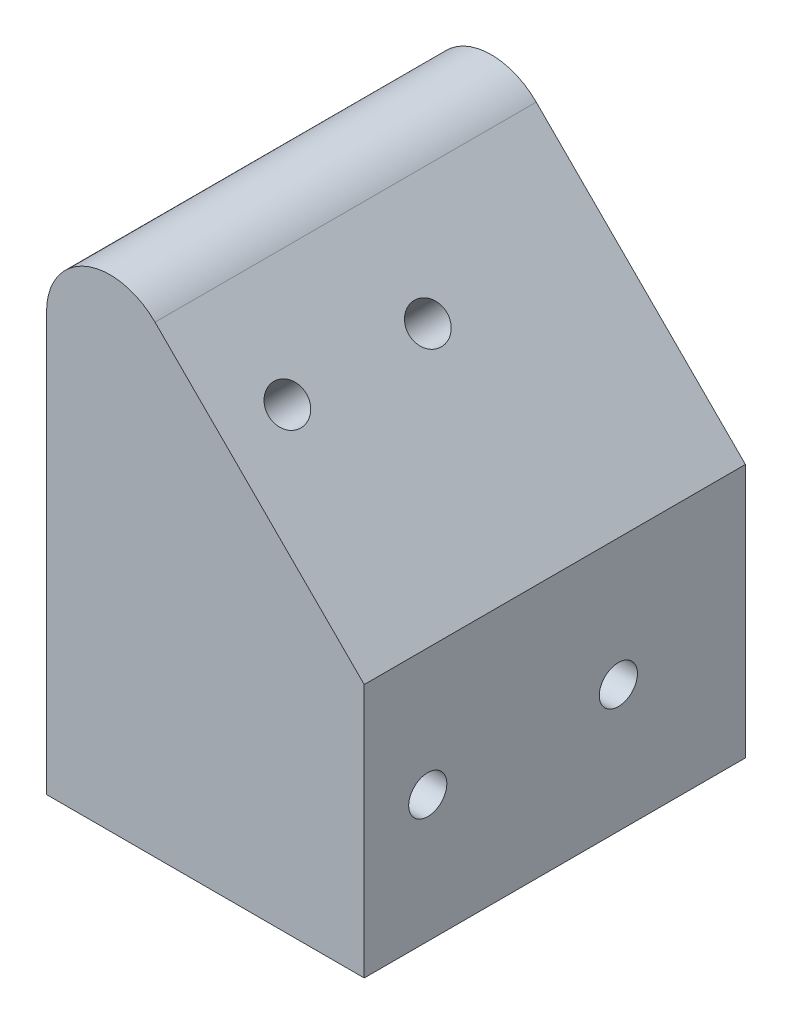
ISO-10303-21;
HEADER;
FILE_DESCRIPTION(('STEP AP214'),'2;1');
FILE_NAME('part.step','',(''),(''),'','','');
FILE_SCHEMA(('AUTOMOTIVE_DESIGN { 1 0 10303 214 1 1 1 1 }'));
ENDSEC;
DATA;
#1=APPLICATION_CONTEXT('core data for automotive mechanical design processes');
#2=APPLICATION_PROTOCOL_DEFINITION('international standard','automotive_design',2000,#1);
#3=PRODUCT_CONTEXT('',#1,'mechanical');
#4=PRODUCT('Part','Part','',(#3));
#5=PRODUCT_RELATED_PRODUCT_CATEGORY('part','',(#4));
#6=PRODUCT_DEFINITION_FORMATION('','',#4);
#7=PRODUCT_DEFINITION_CONTEXT('part definition',#1,'design');
#8=PRODUCT_DEFINITION('design','',#6,#7);
#9=PRODUCT_DEFINITION_SHAPE('','',#8);
#10=(LENGTH_UNIT() NAMED_UNIT(*) SI_UNIT(.MILLI.,.METRE.));
#11=(NAMED_UNIT(*) PLANE_ANGLE_UNIT() SI_UNIT($,.RADIAN.));
#12=(NAMED_UNIT(*) SI_UNIT($,.STERADIAN.) SOLID_ANGLE_UNIT());
#13=UNCERTAINTY_MEASURE_WITH_UNIT(LENGTH_MEASURE(1.E-05),#10,'distance_accuracy_value','');
#14=(GEOMETRIC_REPRESENTATION_CONTEXT(3) GLOBAL_UNCERTAINTY_ASSIGNED_CONTEXT((#13)) GLOBAL_UNIT_ASSIGNED_CONTEXT((#10,
#11,#12)) REPRESENTATION_CONTEXT('',''));
#15=CARTESIAN_POINT('',(0.,0.,0.));
#16=DIRECTION('',(0.,0.,1.));
#17=DIRECTION('',(1.,0.,0.));
#18=AXIS2_PLACEMENT_3D('',#15,#16,#17);
#19=CARTESIAN_POINT('',(25.,-20.,0.));
#20=DIRECTION('',(0.,0.,-1.));
#21=DIRECTION('',(1.,0.,0.));
#22=AXIS2_PLACEMENT_3D('',#19,#20,#21);
#23=PLANE('',#22);
#24=DIRECTION('',(0.,1.,0.));
#25=VECTOR('',#24,1.);
#26=CARTESIAN_POINT('',(0.,-20.,0.));
#27=LINE('',#26,#25);
#28=CARTESIAN_POINT('',(0.,-20.,0.));
#29=VERTEX_POINT('',#28);
#30=CARTESIAN_POINT('',(0.,12.9289321881344,0.));
#31=VERTEX_POINT('',#30);
#32=EDGE_CURVE('E107',#29,#31,#27,.T.);
#33=ORIENTED_EDGE('',*,*,#32,.F.);
#34=DIRECTION('',(-1.,0.,0.));
#35=VECTOR('',#34,1.);
#36=CARTESIAN_POINT('',(25.,-20.,0.));
#37=LINE('',#36,#35);
#38=CARTESIAN_POINT('',(25.,-20.,0.));
#39=VERTEX_POINT('',#38);
#40=EDGE_CURVE('E97',#39,#29,#37,.T.);
#41=ORIENTED_EDGE('',*,*,#40,.F.);
#42=DIRECTION('',(0.,1.,0.));
#43=VECTOR('',#42,1.);
#44=CARTESIAN_POINT('',(25.,-20.,0.));
#45=LINE('',#44,#43);
#46=CARTESIAN_POINT('',(25.,0.,0.));
#47=VERTEX_POINT('',#46);
#48=EDGE_CURVE('E81',#39,#47,#45,.T.);
#49=ORIENTED_EDGE('',*,*,#48,.T.);
#50=DIRECTION('',(0.707106781186551,-0.707106781186544,0.));
#51=VECTOR('',#50,1.);
#52=CARTESIAN_POINT('',(0.,24.9999999999997,0.));
#53=LINE('',#52,#51);
#54=CARTESIAN_POINT('',(8.53553390593272,16.4644660940671,0.));
#55=VERTEX_POINT('',#54);
#56=EDGE_CURVE('E88',#55,#47,#53,.T.);
#57=ORIENTED_EDGE('',*,*,#56,.F.);
#58=CARTESIAN_POINT('',(5.,12.9289321881344,0.));
#59=DIRECTION('',(0.,0.,1.));
#60=DIRECTION('',(1.,0.,0.));
#61=AXIS2_PLACEMENT_3D('',#58,#59,#60);
#62=CIRCLE('',#61,5.);
#63=EDGE_CURVE('E118',#31,#55,#62,.F.);
#64=ORIENTED_EDGE('',*,*,#63,.F.);
#65=EDGE_LOOP('',(#33,#41,#49,#57,#64));
#66=FACE_BOUND('',#65,.T.);
#67=ADVANCED_FACE('F33',(#66),#23,.F.);
#68=CARTESIAN_POINT('',(25.,-20.,-30.));
#69=DIRECTION('',(0.,0.,1.));
#70=DIRECTION('',(-1.,0.,0.));
#71=AXIS2_PLACEMENT_3D('',#68,#69,#70);
#72=PLANE('',#71);
#73=DIRECTION('',(0.707106781186551,-0.707106781186544,0.));
#74=VECTOR('',#73,1.);
#75=CARTESIAN_POINT('',(0.,24.9999999999997,-30.));
#76=LINE('',#75,#74);
#77=CARTESIAN_POINT('',(8.53553390593272,16.4644660940671,-30.));
#78=VERTEX_POINT('',#77);
#79=CARTESIAN_POINT('',(25.,0.,-30.));
#80=VERTEX_POINT('',#79);
#81=EDGE_CURVE('E92',#78,#80,#76,.T.);
#82=ORIENTED_EDGE('',*,*,#81,.T.);
#83=DIRECTION('',(0.,-1.,0.));
#84=VECTOR('',#83,1.);
#85=CARTESIAN_POINT('',(25.,-20.,-30.));
#86=LINE('',#85,#84);
#87=CARTESIAN_POINT('',(25.,-20.,-30.));
#88=VERTEX_POINT('',#87);
#89=EDGE_CURVE('E84',#80,#88,#86,.T.);
#90=ORIENTED_EDGE('',*,*,#89,.T.);
#91=DIRECTION('',(-1.,0.,0.));
#92=VECTOR('',#91,1.);
#93=CARTESIAN_POINT('',(25.,-20.,-30.));
#94=LINE('',#93,#92);
#95=CARTESIAN_POINT('',(0.,-20.,-30.));
#96=VERTEX_POINT('',#95);
#97=EDGE_CURVE('E113',#88,#96,#94,.T.);
#98=ORIENTED_EDGE('',*,*,#97,.T.);
#99=DIRECTION('',(0.,-1.,0.));
#100=VECTOR('',#99,1.);
#101=CARTESIAN_POINT('',(0.,-20.,-30.));
#102=LINE('',#101,#100);
#103=CARTESIAN_POINT('',(0.,12.9289321881344,-30.));
#104=VERTEX_POINT('',#103);
#105=EDGE_CURVE('E100',#104,#96,#102,.T.);
#106=ORIENTED_EDGE('',*,*,#105,.F.);
#107=CARTESIAN_POINT('',(5.,12.9289321881344,-30.));
#108=DIRECTION('',(0.,0.,-1.));
#109=DIRECTION('',(-1.,0.,0.));
#110=AXIS2_PLACEMENT_3D('',#107,#108,#109);
#111=CIRCLE('',#110,5.);
#112=EDGE_CURVE('E11',#78,#104,#111,.F.);
#113=ORIENTED_EDGE('',*,*,#112,.F.);
#114=EDGE_LOOP('',(#82,#90,#98,#106,#113));
#115=FACE_BOUND('',#114,.T.);
#116=ADVANCED_FACE('F126',(#115),#72,.F.);
#117=CARTESIAN_POINT('',(25.,-20.,0.));
#118=DIRECTION('',(0.,1.,0.));
#119=DIRECTION('',(0.,0.,-1.));
#120=AXIS2_PLACEMENT_3D('',#117,#118,#119);
#121=PLANE('',#120);
#122=DIRECTION('',(0.,0.,1.));
#123=VECTOR('',#122,1.);
#124=CARTESIAN_POINT('',(0.,-20.,0.));
#125=LINE('',#124,#123);
#126=EDGE_CURVE('E98',#96,#29,#125,.T.);
#127=ORIENTED_EDGE('',*,*,#126,.F.);
#128=ORIENTED_EDGE('',*,*,#97,.F.);
#129=DIRECTION('',(0.,0.,1.));
#130=VECTOR('',#129,1.);
#131=CARTESIAN_POINT('',(25.,-20.,0.));
#132=LINE('',#131,#130);
#133=EDGE_CURVE('E105',#88,#39,#132,.T.);
#134=ORIENTED_EDGE('',*,*,#133,.T.);
#135=ORIENTED_EDGE('',*,*,#40,.T.);
#136=EDGE_LOOP('',(#127,#128,#134,#135));
#137=FACE_BOUND('',#136,.T.);
#138=ADVANCED_FACE('F124',(#137),#121,.F.);
#139=CARTESIAN_POINT('',(25.,0.,0.));
#140=DIRECTION('',(1.,0.,0.));
#141=DIRECTION('',(0.,0.,1.));
#142=AXIS2_PLACEMENT_3D('',#139,#140,#141);
#143=PLANE('',#142);
#144=CARTESIAN_POINT('',(25.,-9.99999999999998,-4.99999999999714));
#145=DIRECTION('',(1.,0.,0.));
#146=DIRECTION('',(0.,0.,-1.));
#147=AXIS2_PLACEMENT_3D('',#144,#145,#146);
#148=CIRCLE('',#147,1.5);
#149=CARTESIAN_POINT('',(25.,-9.99999999999998,-6.49999999999714));
#150=VERTEX_POINT('',#149);
#151=EDGE_CURVE('E131',#150,#150,#148,.T.);
#152=ORIENTED_EDGE('',*,*,#151,.F.);
#153=EDGE_LOOP('',(#152));
#154=FACE_BOUND('',#153,.T.);
#155=CARTESIAN_POINT('',(25.,-9.99999999999998,-19.9999999999971));
#156=DIRECTION('',(1.,0.,0.));
#157=DIRECTION('',(0.,0.,-1.));
#158=AXIS2_PLACEMENT_3D('',#155,#156,#157);
#159=CIRCLE('',#158,1.5);
#160=CARTESIAN_POINT('',(25.,-9.99999999999998,-21.4999999999971));
#161=VERTEX_POINT('',#160);
#162=EDGE_CURVE('E93',#161,#161,#159,.T.);
#163=ORIENTED_EDGE('',*,*,#162,.F.);
#164=EDGE_LOOP('',(#163));
#165=FACE_BOUND('',#164,.T.);
#166=ORIENTED_EDGE('',*,*,#48,.F.);
#167=ORIENTED_EDGE('',*,*,#133,.F.);
#168=ORIENTED_EDGE('',*,*,#89,.F.);
#169=DIRECTION('',(0.,0.,-1.));
#170=VECTOR('',#169,1.);
#171=CARTESIAN_POINT('',(25.,0.,0.));
#172=LINE('',#171,#170);
#173=EDGE_CURVE('E78',#47,#80,#172,.T.);
#174=ORIENTED_EDGE('',*,*,#173,.F.);
#175=EDGE_LOOP('',(#166,#167,#168,#174));
#176=FACE_BOUND('',#175,.T.);
#177=ADVANCED_FACE('F79',(#154,#165,#176),#143,.T.);
#178=CARTESIAN_POINT('',(0.,0.,0.));
#179=DIRECTION('',(1.,0.,0.));
#180=DIRECTION('',(0.,0.,1.));
#181=AXIS2_PLACEMENT_3D('',#178,#179,#180);
#182=PLANE('',#181);
#183=CARTESIAN_POINT('',(0.,-2.89921398068884,-5.00066480476496));
#184=DIRECTION('',(-1.,0.,0.));
#185=DIRECTION('',(0.,1.,0.));
#186=AXIS2_PLACEMENT_3D('',#183,#184,#185);
#187=ELLIPSE('',#186,2.12132034360238,1.50000000003022);
#188=CARTESIAN_POINT('',(0.,-0.777893637086456,-5.00066480476496));
#189=VERTEX_POINT('',#188);
#190=EDGE_CURVE('E145',#189,#189,#187,.T.);
#191=ORIENTED_EDGE('',*,*,#190,.F.);
#192=EDGE_LOOP('',(#191));
#193=FACE_BOUND('',#192,.T.);
#194=CARTESIAN_POINT('',(0.,-2.89921398068883,-16.0566278642933));
#195=DIRECTION('',(-1.,0.,0.));
#196=DIRECTION('',(0.,1.,0.));
#197=AXIS2_PLACEMENT_3D('',#194,#195,#196);
#198=ELLIPSE('',#197,2.12132034360238,1.50000000003022);
#199=CARTESIAN_POINT('',(0.,-0.777893637086444,-16.0566278642933));
#200=VERTEX_POINT('',#199);
#201=EDGE_CURVE('E137',#200,#200,#198,.T.);
#202=ORIENTED_EDGE('',*,*,#201,.F.);
#203=EDGE_LOOP('',(#202));
#204=FACE_BOUND('',#203,.T.);
#205=CARTESIAN_POINT('',(0.,-9.99999999999998,-4.99999999999714));
#206=DIRECTION('',(1.,0.,0.));
#207=DIRECTION('',(0.,0.,-1.));
#208=AXIS2_PLACEMENT_3D('',#205,#206,#207);
#209=CIRCLE('',#208,1.5);
#210=CARTESIAN_POINT('',(0.,-9.99999999999998,-6.49999999999714));
#211=VERTEX_POINT('',#210);
#212=EDGE_CURVE('E134',#211,#211,#209,.T.);
#213=ORIENTED_EDGE('',*,*,#212,.T.);
#214=EDGE_LOOP('',(#213));
#215=FACE_BOUND('',#214,.T.);
#216=CARTESIAN_POINT('',(0.,-9.99999999999998,-19.9999999999971));
#217=DIRECTION('',(1.,0.,0.));
#218=DIRECTION('',(0.,0.,-1.));
#219=AXIS2_PLACEMENT_3D('',#216,#217,#218);
#220=CIRCLE('',#219,1.5);
#221=CARTESIAN_POINT('',(0.,-9.99999999999998,-21.4999999999971));
#222=VERTEX_POINT('',#221);
#223=EDGE_CURVE('E128',#222,#222,#220,.T.);
#224=ORIENTED_EDGE('',*,*,#223,.T.);
#225=EDGE_LOOP('',(#224));
#226=FACE_BOUND('',#225,.T.);
#227=ORIENTED_EDGE('',*,*,#105,.T.);
#228=ORIENTED_EDGE('',*,*,#126,.T.);
#229=ORIENTED_EDGE('',*,*,#32,.T.);
#230=DIRECTION('',(0.,0.,1.));
#231=VECTOR('',#230,1.);
#232=CARTESIAN_POINT('',(0.,12.9289321881344,0.));
#233=LINE('',#232,#231);
#234=EDGE_CURVE('E116',#104,#31,#233,.T.);
#235=ORIENTED_EDGE('',*,*,#234,.F.);
#236=EDGE_LOOP('',(#227,#228,#229,#235));
#237=FACE_BOUND('',#236,.T.);
#238=ADVANCED_FACE('F120',(#193,#204,#215,#226,#237),#182,.F.);
#239=CARTESIAN_POINT('',(0.,24.9999999999997,-30.));
#240=DIRECTION('',(0.707106781186544,0.707106781186551,0.));
#241=DIRECTION('',(-0.707106781186551,0.707106781186544,0.));
#242=AXIS2_PLACEMENT_3D('',#239,#240,#241);
#243=PLANE('',#242);
#244=CARTESIAN_POINT('',(13.9496069903443,11.0503930096556,-5.00066480476496));
#245=DIRECTION('',(-0.707106781186544,-0.707106781186551,0.));
#246=DIRECTION('',(-0.707106781186551,0.707106781186544,0.));
#247=AXIS2_PLACEMENT_3D('',#244,#245,#246);
#248=CIRCLE('',#247,1.50000000003022);
#249=CARTESIAN_POINT('',(12.8889468185431,12.1110531814568,-5.00066480476496));
#250=VERTEX_POINT('',#249);
#251=EDGE_CURVE('E148',#250,#250,#248,.T.);
#252=ORIENTED_EDGE('',*,*,#251,.T.);
#253=EDGE_LOOP('',(#252));
#254=FACE_BOUND('',#253,.T.);
#255=CARTESIAN_POINT('',(13.9496069903443,11.0503930096556,-16.0566278642933));
#256=DIRECTION('',(-0.707106781186544,-0.707106781186551,0.));
#257=DIRECTION('',(-0.707106781186551,0.707106781186544,0.));
#258=AXIS2_PLACEMENT_3D('',#255,#256,#257);
#259=CIRCLE('',#258,1.50000000003022);
#260=CARTESIAN_POINT('',(12.8889468185431,12.1110531814568,-16.0566278642933));
#261=VERTEX_POINT('',#260);
#262=EDGE_CURVE('E142',#261,#261,#259,.T.);
#263=ORIENTED_EDGE('',*,*,#262,.T.);
#264=EDGE_LOOP('',(#263));
#265=FACE_BOUND('',#264,.T.);
#266=ORIENTED_EDGE('',*,*,#56,.T.);
#267=ORIENTED_EDGE('',*,*,#173,.T.);
#268=ORIENTED_EDGE('',*,*,#81,.F.);
#269=DIRECTION('',(0.,0.,1.));
#270=VECTOR('',#269,1.);
#271=CARTESIAN_POINT('',(8.53553390593272,16.4644660940671,-30.));
#272=LINE('',#271,#270);
#273=EDGE_CURVE('E41',#55,#78,#272,.F.);
#274=ORIENTED_EDGE('',*,*,#273,.F.);
#275=EDGE_LOOP('',(#266,#267,#268,#274));
#276=FACE_BOUND('',#275,.T.);
#277=ADVANCED_FACE('F89',(#254,#265,#276),#243,.T.);
#278=CARTESIAN_POINT('',(5.,12.9289321881344,0.));
#279=DIRECTION('',(0.,0.,-1.));
#280=DIRECTION('',(1.,0.,0.));
#281=AXIS2_PLACEMENT_3D('',#278,#279,#280);
#282=CYLINDRICAL_SURFACE('',#281,5.);
#283=ORIENTED_EDGE('',*,*,#112,.T.);
#284=ORIENTED_EDGE('',*,*,#234,.T.);
#285=ORIENTED_EDGE('',*,*,#63,.T.);
#286=ORIENTED_EDGE('',*,*,#273,.T.);
#287=EDGE_LOOP('',(#283,#284,#285,#286));
#288=FACE_BOUND('',#287,.T.);
#289=ADVANCED_FACE('F35',(#288),#282,.T.);
#290=CARTESIAN_POINT('',(25.,-9.99999999999998,-19.9999999999971));
#291=DIRECTION('',(-1.,0.,0.));
#292=DIRECTION('',(0.,0.,-1.));
#293=AXIS2_PLACEMENT_3D('',#290,#291,#292);
#294=CYLINDRICAL_SURFACE('',#293,1.5);
#295=ORIENTED_EDGE('',*,*,#162,.T.);
#296=EDGE_LOOP('',(#295));
#297=FACE_BOUND('',#296,.T.);
#298=ORIENTED_EDGE('',*,*,#223,.F.);
#299=EDGE_LOOP('',(#298));
#300=FACE_BOUND('',#299,.T.);
#301=ADVANCED_FACE('F170',(#297,#300),#294,.F.);
#302=CARTESIAN_POINT('',(25.,-9.99999999999998,-4.99999999999714));
#303=DIRECTION('',(-1.,0.,0.));
#304=DIRECTION('',(0.,0.,-1.));
#305=AXIS2_PLACEMENT_3D('',#302,#303,#304);
#306=CYLINDRICAL_SURFACE('',#305,1.5);
#307=ORIENTED_EDGE('',*,*,#151,.T.);
#308=EDGE_LOOP('',(#307));
#309=FACE_BOUND('',#308,.T.);
#310=ORIENTED_EDGE('',*,*,#212,.F.);
#311=EDGE_LOOP('',(#310));
#312=FACE_BOUND('',#311,.T.);
#313=ADVANCED_FACE('F172',(#309,#312),#306,.F.);
#314=CARTESIAN_POINT('',(-8.55039300965559,-11.4496069903445,-16.0566278642933));
#315=DIRECTION('',(0.707106781186544,0.707106781186551,0.));
#316=DIRECTION('',(-0.707106781186551,0.707106781186544,0.));
#317=AXIS2_PLACEMENT_3D('',#314,#315,#316);
#318=CYLINDRICAL_SURFACE('',#317,1.50000000003022);
#319=ORIENTED_EDGE('',*,*,#262,.F.);
#320=EDGE_LOOP('',(#319));
#321=FACE_BOUND('',#320,.T.);
#322=ORIENTED_EDGE('',*,*,#201,.T.);
#323=EDGE_LOOP('',(#322));
#324=FACE_BOUND('',#323,.T.);
#325=ADVANCED_FACE('F157',(#321,#324),#318,.F.);
#326=CARTESIAN_POINT('',(-8.55039300965558,-11.4496069903445,-5.00066480476496));
#327=DIRECTION('',(0.707106781186544,0.707106781186551,0.));
#328=DIRECTION('',(-0.707106781186551,0.707106781186544,0.));
#329=AXIS2_PLACEMENT_3D('',#326,#327,#328);
#330=CYLINDRICAL_SURFACE('',#329,1.50000000003022);
#331=ORIENTED_EDGE('',*,*,#251,.F.);
#332=EDGE_LOOP('',(#331));
#333=FACE_BOUND('',#332,.T.);
#334=ORIENTED_EDGE('',*,*,#190,.T.);
#335=EDGE_LOOP('',(#334));
#336=FACE_BOUND('',#335,.T.);
#337=ADVANCED_FACE('F154',(#333,#336),#330,.F.);
#338=CLOSED_SHELL('',(#67,#116,#138,#177,#238,#277,#289,#301,#313,#325,#337));
#339=MANIFOLD_SOLID_BREP('B2',#338);
#340=ADVANCED_BREP_SHAPE_REPRESENTATION('',(#18,#339),#14);
#341=SHAPE_DEFINITION_REPRESENTATION(#9,#340);
ENDSEC;
END-ISO-10303-21;
